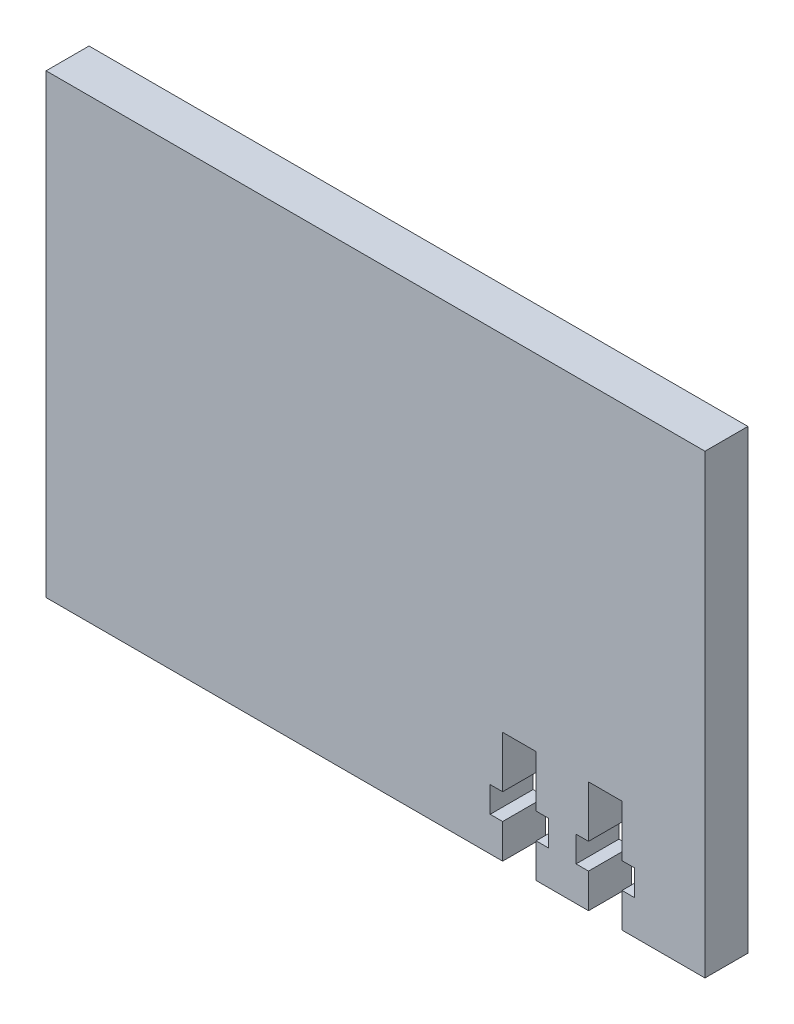
ISO-10303-21;
HEADER;
FILE_DESCRIPTION(('STEP AP214'),'2;1');
FILE_NAME('part.step','',(''),(''),'','','');
FILE_SCHEMA(('AUTOMOTIVE_DESIGN { 1 0 10303 214 1 1 1 1 }'));
ENDSEC;
DATA;
#1=APPLICATION_CONTEXT('core data for automotive mechanical design processes');
#2=APPLICATION_PROTOCOL_DEFINITION('international standard','automotive_design',2000,#1);
#3=PRODUCT_CONTEXT('',#1,'mechanical');
#4=PRODUCT('Part','Part','',(#3));
#5=PRODUCT_RELATED_PRODUCT_CATEGORY('part','',(#4));
#6=PRODUCT_DEFINITION_FORMATION('','',#4);
#7=PRODUCT_DEFINITION_CONTEXT('part definition',#1,'design');
#8=PRODUCT_DEFINITION('design','',#6,#7);
#9=PRODUCT_DEFINITION_SHAPE('','',#8);
#10=(LENGTH_UNIT() NAMED_UNIT(*) SI_UNIT(.MILLI.,.METRE.));
#11=(NAMED_UNIT(*) PLANE_ANGLE_UNIT() SI_UNIT($,.RADIAN.));
#12=(NAMED_UNIT(*) SI_UNIT($,.STERADIAN.) SOLID_ANGLE_UNIT());
#13=UNCERTAINTY_MEASURE_WITH_UNIT(LENGTH_MEASURE(1.E-05),#10,'distance_accuracy_value','');
#14=(GEOMETRIC_REPRESENTATION_CONTEXT(3) GLOBAL_UNCERTAINTY_ASSIGNED_CONTEXT((#13)) GLOBAL_UNIT_ASSIGNED_CONTEXT((#10,
#11,#12)) REPRESENTATION_CONTEXT('',''));
#15=CARTESIAN_POINT('',(0.,0.,0.));
#16=DIRECTION('',(0.,0.,1.));
#17=DIRECTION('',(1.,0.,0.));
#18=AXIS2_PLACEMENT_3D('',#15,#16,#17);
#19=CARTESIAN_POINT('',(-222.995661641974,-55.,-5.));
#20=DIRECTION('',(0.,1.,0.));
#21=DIRECTION('',(-1.,0.,0.));
#22=AXIS2_PLACEMENT_3D('',#19,#20,#21);
#23=PLANE('',#22);
#24=DIRECTION('',(-1.,0.,0.));
#25=VECTOR('',#24,1.);
#26=CARTESIAN_POINT('',(-222.995661641974,-55.,0.));
#27=LINE('',#26,#25);
#28=CARTESIAN_POINT('',(-146.2775,-55.,0.));
#29=VERTEX_POINT('',#28);
#30=CARTESIAN_POINT('',(-155.9375,-55.0000000000002,0.));
#31=VERTEX_POINT('',#30);
#32=EDGE_CURVE('E260',#29,#31,#27,.T.);
#33=ORIENTED_EDGE('',*,*,#32,.T.);
#34=DIRECTION('',(0.,0.,-1.));
#35=VECTOR('',#34,1.);
#36=CARTESIAN_POINT('',(-155.9375,-55.0000000000002,5.));
#37=LINE('',#36,#35);
#38=CARTESIAN_POINT('',(-155.9375,-55.0000000000002,-5.));
#39=VERTEX_POINT('',#38);
#40=EDGE_CURVE('E257',#31,#39,#37,.T.);
#41=ORIENTED_EDGE('',*,*,#40,.T.);
#42=DIRECTION('',(-1.,0.,0.));
#43=VECTOR('',#42,1.);
#44=CARTESIAN_POINT('',(-222.995661641974,-55.,-5.));
#45=LINE('',#44,#43);
#46=CARTESIAN_POINT('',(-146.2775,-55.,-5.));
#47=VERTEX_POINT('',#46);
#48=EDGE_CURVE('E242',#47,#39,#45,.T.);
#49=ORIENTED_EDGE('',*,*,#48,.F.);
#50=DIRECTION('',(0.,0.,1.));
#51=VECTOR('',#50,1.);
#52=CARTESIAN_POINT('',(-146.2775,-55.,-5.));
#53=LINE('',#52,#51);
#54=EDGE_CURVE('E272',#47,#29,#53,.T.);
#55=ORIENTED_EDGE('',*,*,#54,.T.);
#56=EDGE_LOOP('',(#33,#41,#49,#55));
#57=FACE_BOUND('',#56,.T.);
#58=ADVANCED_FACE('F33',(#57),#23,.F.);
#59=CARTESIAN_POINT('',(-159.8375,-55.0000000000002,-5.));
#60=VERTEX_POINT('',#59);
#61=CARTESIAN_POINT('',(-165.9375,-55.,-5.));
#62=VERTEX_POINT('',#61);
#63=EDGE_CURVE('E234',#60,#62,#45,.T.);
#64=ORIENTED_EDGE('',*,*,#63,.F.);
#65=DIRECTION('',(0.,0.,-1.));
#66=VECTOR('',#65,1.);
#67=CARTESIAN_POINT('',(-159.8375,-55.0000000000002,5.));
#68=LINE('',#67,#66);
#69=CARTESIAN_POINT('',(-159.8375,-55.0000000000002,0.));
#70=VERTEX_POINT('',#69);
#71=EDGE_CURVE('E216',#70,#60,#68,.T.);
#72=ORIENTED_EDGE('',*,*,#71,.F.);
#73=CARTESIAN_POINT('',(-165.9375,-55.,0.));
#74=VERTEX_POINT('',#73);
#75=EDGE_CURVE('E264',#70,#74,#27,.T.);
#76=ORIENTED_EDGE('',*,*,#75,.T.);
#77=DIRECTION('',(0.,0.,-1.));
#78=VECTOR('',#77,1.);
#79=CARTESIAN_POINT('',(-165.9375,-55.,5.));
#80=LINE('',#79,#78);
#81=EDGE_CURVE('E238',#74,#62,#80,.T.);
#82=ORIENTED_EDGE('',*,*,#81,.T.);
#83=EDGE_LOOP('',(#64,#72,#76,#82));
#84=FACE_BOUND('',#83,.T.);
#85=ADVANCED_FACE('F241',(#84),#23,.F.);
#86=CARTESIAN_POINT('',(-222.995661641974,-1.87999999999998,-5.));
#87=DIRECTION('',(0.,-1.,0.));
#88=DIRECTION('',(1.,0.,0.));
#89=AXIS2_PLACEMENT_3D('',#86,#87,#88);
#90=PLANE('',#89);
#91=DIRECTION('',(1.,0.,0.));
#92=VECTOR('',#91,1.);
#93=CARTESIAN_POINT('',(-222.995661641974,-1.87999999999998,0.));
#94=LINE('',#93,#92);
#95=CARTESIAN_POINT('',(-222.995661641974,-1.87999999999998,0.));
#96=VERTEX_POINT('',#95);
#97=CARTESIAN_POINT('',(-146.2775,-1.87999999999999,0.));
#98=VERTEX_POINT('',#97);
#99=EDGE_CURVE('E253',#96,#98,#94,.T.);
#100=ORIENTED_EDGE('',*,*,#99,.T.);
#101=DIRECTION('',(0.,0.,1.));
#102=VECTOR('',#101,1.);
#103=CARTESIAN_POINT('',(-146.2775,-1.87999999999999,-5.));
#104=LINE('',#103,#102);
#105=CARTESIAN_POINT('',(-146.2775,-1.87999999999999,-5.));
#106=VERTEX_POINT('',#105);
#107=EDGE_CURVE('E275',#106,#98,#104,.T.);
#108=ORIENTED_EDGE('',*,*,#107,.F.);
#109=DIRECTION('',(1.,0.,0.));
#110=VECTOR('',#109,1.);
#111=CARTESIAN_POINT('',(-222.995661641974,-1.87999999999998,-5.));
#112=LINE('',#111,#110);
#113=CARTESIAN_POINT('',(-222.995661641974,-1.87999999999998,-5.));
#114=VERTEX_POINT('',#113);
#115=EDGE_CURVE('E266',#114,#106,#112,.T.);
#116=ORIENTED_EDGE('',*,*,#115,.F.);
#117=DIRECTION('',(0.,0.,1.));
#118=VECTOR('',#117,1.);
#119=CARTESIAN_POINT('',(-222.995661641974,-1.87999999999998,-5.));
#120=LINE('',#119,#118);
#121=EDGE_CURVE('E252',#114,#96,#120,.T.);
#122=ORIENTED_EDGE('',*,*,#121,.T.);
#123=EDGE_LOOP('',(#100,#108,#116,#122));
#124=FACE_BOUND('',#123,.T.);
#125=ADVANCED_FACE('F35',(#124),#90,.F.);
#126=CARTESIAN_POINT('',(-146.2775,-1.87999999999999,-5.));
#127=DIRECTION('',(-1.,0.,0.));
#128=DIRECTION('',(0.,0.,1.));
#129=AXIS2_PLACEMENT_3D('',#126,#127,#128);
#130=PLANE('',#129);
#131=DIRECTION('',(0.,-1.,0.));
#132=VECTOR('',#131,1.);
#133=CARTESIAN_POINT('',(-146.2775,-1.87999999999999,0.));
#134=LINE('',#133,#132);
#135=EDGE_CURVE('E256',#98,#29,#134,.T.);
#136=ORIENTED_EDGE('',*,*,#135,.T.);
#137=ORIENTED_EDGE('',*,*,#54,.F.);
#138=DIRECTION('',(0.,-1.,0.));
#139=VECTOR('',#138,1.);
#140=CARTESIAN_POINT('',(-146.2775,-1.87999999999999,-5.));
#141=LINE('',#140,#139);
#142=EDGE_CURVE('E247',#106,#47,#141,.T.);
#143=ORIENTED_EDGE('',*,*,#142,.F.);
#144=ORIENTED_EDGE('',*,*,#107,.T.);
#145=EDGE_LOOP('',(#136,#137,#143,#144));
#146=FACE_BOUND('',#145,.T.);
#147=ADVANCED_FACE('F430',(#146),#130,.F.);
#148=CARTESIAN_POINT('',(-169.8375,-55.,-5.));
#149=VERTEX_POINT('',#148);
#150=CARTESIAN_POINT('',(-222.995661641974,-55.,-5.));
#151=VERTEX_POINT('',#150);
#152=EDGE_CURVE('E243',#149,#151,#45,.T.);
#153=ORIENTED_EDGE('',*,*,#152,.F.);
#154=DIRECTION('',(0.,0.,-1.));
#155=VECTOR('',#154,1.);
#156=CARTESIAN_POINT('',(-169.8375,-55.,5.));
#157=LINE('',#156,#155);
#158=CARTESIAN_POINT('',(-169.8375,-55.,0.));
#159=VERTEX_POINT('',#158);
#160=EDGE_CURVE('E403',#159,#149,#157,.T.);
#161=ORIENTED_EDGE('',*,*,#160,.F.);
#162=CARTESIAN_POINT('',(-222.995661641974,-55.,0.));
#163=VERTEX_POINT('',#162);
#164=EDGE_CURVE('E259',#159,#163,#27,.T.);
#165=ORIENTED_EDGE('',*,*,#164,.T.);
#166=DIRECTION('',(0.,0.,1.));
#167=VECTOR('',#166,1.);
#168=CARTESIAN_POINT('',(-222.995661641974,-55.,-5.));
#169=LINE('',#168,#167);
#170=EDGE_CURVE('E269',#151,#163,#169,.T.);
#171=ORIENTED_EDGE('',*,*,#170,.F.);
#172=EDGE_LOOP('',(#153,#161,#165,#171));
#173=FACE_BOUND('',#172,.T.);
#174=ADVANCED_FACE('F470',(#173),#23,.F.);
#175=CARTESIAN_POINT('',(-222.995661641974,-1.87999999999998,-5.));
#176=DIRECTION('',(1.,0.,0.));
#177=DIRECTION('',(0.,1.,0.));
#178=AXIS2_PLACEMENT_3D('',#175,#176,#177);
#179=PLANE('',#178);
#180=DIRECTION('',(0.,1.,0.));
#181=VECTOR('',#180,1.);
#182=CARTESIAN_POINT('',(-222.995661641974,-1.87999999999998,0.));
#183=LINE('',#182,#181);
#184=EDGE_CURVE('E263',#163,#96,#183,.T.);
#185=ORIENTED_EDGE('',*,*,#184,.T.);
#186=ORIENTED_EDGE('',*,*,#121,.F.);
#187=DIRECTION('',(0.,1.,0.));
#188=VECTOR('',#187,1.);
#189=CARTESIAN_POINT('',(-222.995661641974,-1.87999999999998,-5.));
#190=LINE('',#189,#188);
#191=EDGE_CURVE('E246',#151,#114,#190,.T.);
#192=ORIENTED_EDGE('',*,*,#191,.F.);
#193=ORIENTED_EDGE('',*,*,#170,.T.);
#194=EDGE_LOOP('',(#185,#186,#192,#193));
#195=FACE_BOUND('',#194,.T.);
#196=ADVANCED_FACE('F474',(#195),#179,.F.);
#197=CARTESIAN_POINT('',(0.,0.,-5.));
#198=DIRECTION('',(0.,0.,-1.));
#199=DIRECTION('',(-1.,0.,0.));
#200=AXIS2_PLACEMENT_3D('',#197,#198,#199);
#201=PLANE('',#200);
#202=DIRECTION('',(0.,-1.,0.));
#203=VECTOR('',#202,1.);
#204=CARTESIAN_POINT('',(-155.9375,-55.0000000000002,-5.));
#205=LINE('',#204,#203);
#206=CARTESIAN_POINT('',(-155.9375,-51.0000000000002,-5.));
#207=VERTEX_POINT('',#206);
#208=EDGE_CURVE('E227',#207,#39,#205,.T.);
#209=ORIENTED_EDGE('',*,*,#208,.F.);
#210=DIRECTION('',(-1.,0.,0.));
#211=VECTOR('',#210,1.);
#212=CARTESIAN_POINT('',(-155.9375,-51.0000000000002,-5.));
#213=LINE('',#212,#211);
#214=CARTESIAN_POINT('',(-154.487499999999,-51.0000000000002,-5.));
#215=VERTEX_POINT('',#214);
#216=EDGE_CURVE('E436',#215,#207,#213,.T.);
#217=ORIENTED_EDGE('',*,*,#216,.F.);
#218=DIRECTION('',(0.,-1.,0.));
#219=VECTOR('',#218,1.);
#220=CARTESIAN_POINT('',(-154.487499999999,-48.0000000000002,-5.));
#221=LINE('',#220,#219);
#222=CARTESIAN_POINT('',(-154.487499999999,-48.0000000000002,-5.));
#223=VERTEX_POINT('',#222);
#224=EDGE_CURVE('E351',#223,#215,#221,.T.);
#225=ORIENTED_EDGE('',*,*,#224,.F.);
#226=DIRECTION('',(1.,0.,0.));
#227=VECTOR('',#226,1.);
#228=CARTESIAN_POINT('',(-155.9375,-48.0000000000002,-5.));
#229=LINE('',#228,#227);
#230=CARTESIAN_POINT('',(-155.9375,-48.0000000000002,-5.));
#231=VERTEX_POINT('',#230);
#232=EDGE_CURVE('E439',#231,#223,#229,.T.);
#233=ORIENTED_EDGE('',*,*,#232,.F.);
#234=DIRECTION('',(0.,-1.,0.));
#235=VECTOR('',#234,1.);
#236=CARTESIAN_POINT('',(-155.9375,-48.0000000000002,-5.));
#237=LINE('',#236,#235);
#238=CARTESIAN_POINT('',(-155.9375,-42.,-5.));
#239=VERTEX_POINT('',#238);
#240=EDGE_CURVE('E442',#239,#231,#237,.T.);
#241=ORIENTED_EDGE('',*,*,#240,.F.);
#242=DIRECTION('',(1.,0.,0.));
#243=VECTOR('',#242,1.);
#244=CARTESIAN_POINT('',(-155.9375,-42.,-5.));
#245=LINE('',#244,#243);
#246=CARTESIAN_POINT('',(-159.8375,-42.,-5.));
#247=VERTEX_POINT('',#246);
#248=EDGE_CURVE('E445',#247,#239,#245,.T.);
#249=ORIENTED_EDGE('',*,*,#248,.F.);
#250=DIRECTION('',(0.,1.,0.));
#251=VECTOR('',#250,1.);
#252=CARTESIAN_POINT('',(-159.8375,-48.0000000000002,-5.));
#253=LINE('',#252,#251);
#254=CARTESIAN_POINT('',(-159.8375,-48.0000000000002,-5.));
#255=VERTEX_POINT('',#254);
#256=EDGE_CURVE('E448',#255,#247,#253,.T.);
#257=ORIENTED_EDGE('',*,*,#256,.F.);
#258=DIRECTION('',(1.,0.,0.));
#259=VECTOR('',#258,1.);
#260=CARTESIAN_POINT('',(-159.8375,-48.0000000000002,-5.));
#261=LINE('',#260,#259);
#262=CARTESIAN_POINT('',(-161.287500000001,-48.0000000000002,-5.));
#263=VERTEX_POINT('',#262);
#264=EDGE_CURVE('E451',#263,#255,#261,.T.);
#265=ORIENTED_EDGE('',*,*,#264,.F.);
#266=DIRECTION('',(0.,1.,0.));
#267=VECTOR('',#266,1.);
#268=CARTESIAN_POINT('',(-161.287500000001,-48.0000000000002,-5.));
#269=LINE('',#268,#267);
#270=CARTESIAN_POINT('',(-161.287500000001,-51.0000000000002,-5.));
#271=VERTEX_POINT('',#270);
#272=EDGE_CURVE('E454',#271,#263,#269,.T.);
#273=ORIENTED_EDGE('',*,*,#272,.F.);
#274=DIRECTION('',(-1.,0.,0.));
#275=VECTOR('',#274,1.);
#276=CARTESIAN_POINT('',(-159.8375,-51.0000000000002,-5.));
#277=LINE('',#276,#275);
#278=CARTESIAN_POINT('',(-159.8375,-51.0000000000002,-5.));
#279=VERTEX_POINT('',#278);
#280=EDGE_CURVE('E237',#279,#271,#277,.T.);
#281=ORIENTED_EDGE('',*,*,#280,.F.);
#282=DIRECTION('',(0.,1.,0.));
#283=VECTOR('',#282,1.);
#284=CARTESIAN_POINT('',(-159.8375,-55.0000000000002,-5.));
#285=LINE('',#284,#283);
#286=EDGE_CURVE('E219',#60,#279,#285,.T.);
#287=ORIENTED_EDGE('',*,*,#286,.F.);
#288=ORIENTED_EDGE('',*,*,#63,.T.);
#289=DIRECTION('',(0.,-1.,0.));
#290=VECTOR('',#289,1.);
#291=CARTESIAN_POINT('',(-165.9375,-55.,-5.));
#292=LINE('',#291,#290);
#293=CARTESIAN_POINT('',(-165.9375,-51.,-5.));
#294=VERTEX_POINT('',#293);
#295=EDGE_CURVE('E401',#294,#62,#292,.T.);
#296=ORIENTED_EDGE('',*,*,#295,.F.);
#297=DIRECTION('',(-1.,0.,0.));
#298=VECTOR('',#297,1.);
#299=CARTESIAN_POINT('',(-165.9375,-51.,-5.));
#300=LINE('',#299,#298);
#301=CARTESIAN_POINT('',(-164.4875,-51.,-5.));
#302=VERTEX_POINT('',#301);
#303=EDGE_CURVE('E398',#302,#294,#300,.T.);
#304=ORIENTED_EDGE('',*,*,#303,.F.);
#305=DIRECTION('',(0.,-1.,0.));
#306=VECTOR('',#305,1.);
#307=CARTESIAN_POINT('',(-164.4875,-48.,-5.));
#308=LINE('',#307,#306);
#309=CARTESIAN_POINT('',(-164.4875,-48.,-5.));
#310=VERTEX_POINT('',#309);
#311=EDGE_CURVE('E395',#310,#302,#308,.T.);
#312=ORIENTED_EDGE('',*,*,#311,.F.);
#313=DIRECTION('',(1.,0.,0.));
#314=VECTOR('',#313,1.);
#315=CARTESIAN_POINT('',(-165.9375,-48.,-5.));
#316=LINE('',#315,#314);
#317=CARTESIAN_POINT('',(-165.9375,-48.,-5.));
#318=VERTEX_POINT('',#317);
#319=EDGE_CURVE('E392',#318,#310,#316,.T.);
#320=ORIENTED_EDGE('',*,*,#319,.F.);
#321=DIRECTION('',(0.,-1.,0.));
#322=VECTOR('',#321,1.);
#323=CARTESIAN_POINT('',(-165.9375,-48.,-5.));
#324=LINE('',#323,#322);
#325=CARTESIAN_POINT('',(-165.9375,-42.,-5.));
#326=VERTEX_POINT('',#325);
#327=EDGE_CURVE('E389',#326,#318,#324,.T.);
#328=ORIENTED_EDGE('',*,*,#327,.F.);
#329=DIRECTION('',(1.,0.,0.));
#330=VECTOR('',#329,1.);
#331=CARTESIAN_POINT('',(-165.9375,-42.,-5.));
#332=LINE('',#331,#330);
#333=CARTESIAN_POINT('',(-169.8375,-42.,-5.));
#334=VERTEX_POINT('',#333);
#335=EDGE_CURVE('E386',#334,#326,#332,.T.);
#336=ORIENTED_EDGE('',*,*,#335,.F.);
#337=DIRECTION('',(0.,1.,0.));
#338=VECTOR('',#337,1.);
#339=CARTESIAN_POINT('',(-169.8375,-48.,-5.));
#340=LINE('',#339,#338);
#341=CARTESIAN_POINT('',(-169.8375,-48.,-5.));
#342=VERTEX_POINT('',#341);
#343=EDGE_CURVE('E383',#342,#334,#340,.T.);
#344=ORIENTED_EDGE('',*,*,#343,.F.);
#345=DIRECTION('',(1.,0.,0.));
#346=VECTOR('',#345,1.);
#347=CARTESIAN_POINT('',(-169.8375,-48.,-5.));
#348=LINE('',#347,#346);
#349=CARTESIAN_POINT('',(-171.2875,-48.,-5.));
#350=VERTEX_POINT('',#349);
#351=EDGE_CURVE('E380',#350,#342,#348,.T.);
#352=ORIENTED_EDGE('',*,*,#351,.F.);
#353=DIRECTION('',(0.,1.,0.));
#354=VECTOR('',#353,1.);
#355=CARTESIAN_POINT('',(-171.2875,-48.,-5.));
#356=LINE('',#355,#354);
#357=CARTESIAN_POINT('',(-171.2875,-51.,-5.));
#358=VERTEX_POINT('',#357);
#359=EDGE_CURVE('E377',#358,#350,#356,.T.);
#360=ORIENTED_EDGE('',*,*,#359,.F.);
#361=DIRECTION('',(-1.,0.,0.));
#362=VECTOR('',#361,1.);
#363=CARTESIAN_POINT('',(-169.8375,-51.,-5.));
#364=LINE('',#363,#362);
#365=CARTESIAN_POINT('',(-169.8375,-51.,-5.));
#366=VERTEX_POINT('',#365);
#367=EDGE_CURVE('E374',#366,#358,#364,.T.);
#368=ORIENTED_EDGE('',*,*,#367,.F.);
#369=DIRECTION('',(0.,1.,0.));
#370=VECTOR('',#369,1.);
#371=CARTESIAN_POINT('',(-169.8375,-55.,-5.));
#372=LINE('',#371,#370);
#373=EDGE_CURVE('E372',#149,#366,#372,.T.);
#374=ORIENTED_EDGE('',*,*,#373,.F.);
#375=ORIENTED_EDGE('',*,*,#152,.T.);
#376=ORIENTED_EDGE('',*,*,#191,.T.);
#377=ORIENTED_EDGE('',*,*,#115,.T.);
#378=ORIENTED_EDGE('',*,*,#142,.T.);
#379=ORIENTED_EDGE('',*,*,#48,.T.);
#380=EDGE_LOOP('',(#209,#217,#225,#233,#241,#249,#257,#265,#273,#281,#287,#288,#296,#304,#312,
#320,#328,#336,#344,#352,#360,#368,#374,#375,#376,#377,#378,#379));
#381=FACE_BOUND('',#380,.T.);
#382=ADVANCED_FACE('F232',(#381),#201,.T.);
#383=CARTESIAN_POINT('',(0.,0.,0.));
#384=DIRECTION('',(0.,0.,-1.));
#385=DIRECTION('',(-1.,0.,0.));
#386=AXIS2_PLACEMENT_3D('',#383,#384,#385);
#387=PLANE('',#386);
#388=DIRECTION('',(-1.,0.,0.));
#389=VECTOR('',#388,1.);
#390=CARTESIAN_POINT('',(0.,-51.0000000000002,0.));
#391=LINE('',#390,#389);
#392=CARTESIAN_POINT('',(-154.487499999999,-51.0000000000002,0.));
#393=VERTEX_POINT('',#392);
#394=CARTESIAN_POINT('',(-155.9375,-51.0000000000002,0.));
#395=VERTEX_POINT('',#394);
#396=EDGE_CURVE('E41',#393,#395,#391,.T.);
#397=ORIENTED_EDGE('',*,*,#396,.T.);
#398=DIRECTION('',(0.,-1.,0.));
#399=VECTOR('',#398,1.);
#400=CARTESIAN_POINT('',(-155.9375,0.,0.));
#401=LINE('',#400,#399);
#402=EDGE_CURVE('E11',#395,#31,#401,.T.);
#403=ORIENTED_EDGE('',*,*,#402,.T.);
#404=ORIENTED_EDGE('',*,*,#32,.F.);
#405=ORIENTED_EDGE('',*,*,#135,.F.);
#406=ORIENTED_EDGE('',*,*,#99,.F.);
#407=ORIENTED_EDGE('',*,*,#184,.F.);
#408=ORIENTED_EDGE('',*,*,#164,.F.);
#409=DIRECTION('',(0.,1.,0.));
#410=VECTOR('',#409,1.);
#411=CARTESIAN_POINT('',(-169.8375,1.17848439340484E-12,0.));
#412=LINE('',#411,#410);
#413=CARTESIAN_POINT('',(-169.8375,-51.,0.));
#414=VERTEX_POINT('',#413);
#415=EDGE_CURVE('E278',#159,#414,#412,.T.);
#416=ORIENTED_EDGE('',*,*,#415,.T.);
#417=DIRECTION('',(-1.,0.,0.));
#418=VECTOR('',#417,1.);
#419=CARTESIAN_POINT('',(-2.44057647654671E-13,-51.0000000000008,0.));
#420=LINE('',#419,#418);
#421=CARTESIAN_POINT('',(-171.2875,-51.,0.));
#422=VERTEX_POINT('',#421);
#423=EDGE_CURVE('E281',#414,#422,#420,.T.);
#424=ORIENTED_EDGE('',*,*,#423,.T.);
#425=DIRECTION('',(0.,1.,0.));
#426=VECTOR('',#425,1.);
#427=CARTESIAN_POINT('',(-171.2875,0.,0.));
#428=LINE('',#427,#426);
#429=CARTESIAN_POINT('',(-171.2875,-48.,0.));
#430=VERTEX_POINT('',#429);
#431=EDGE_CURVE('E284',#422,#430,#428,.T.);
#432=ORIENTED_EDGE('',*,*,#431,.T.);
#433=DIRECTION('',(1.,0.,0.));
#434=VECTOR('',#433,1.);
#435=CARTESIAN_POINT('',(-2.2970131543969E-13,-48.0000000000008,0.));
#436=LINE('',#435,#434);
#437=CARTESIAN_POINT('',(-169.8375,-48.,0.));
#438=VERTEX_POINT('',#437);
#439=EDGE_CURVE('E287',#430,#438,#436,.T.);
#440=ORIENTED_EDGE('',*,*,#439,.T.);
#441=DIRECTION('',(0.,1.,0.));
#442=VECTOR('',#441,1.);
#443=CARTESIAN_POINT('',(-169.8375,-7.85656262269896E-13,0.));
#444=LINE('',#443,#442);
#445=CARTESIAN_POINT('',(-169.8375,-42.,0.));
#446=VERTEX_POINT('',#445);
#447=EDGE_CURVE('E290',#438,#446,#444,.T.);
#448=ORIENTED_EDGE('',*,*,#447,.T.);
#449=DIRECTION('',(1.,0.,0.));
#450=VECTOR('',#449,1.);
#451=CARTESIAN_POINT('',(0.,-42.,0.));
#452=LINE('',#451,#450);
#453=CARTESIAN_POINT('',(-165.9375,-42.,0.));
#454=VERTEX_POINT('',#453);
#455=EDGE_CURVE('E293',#446,#454,#452,.T.);
#456=ORIENTED_EDGE('',*,*,#455,.T.);
#457=DIRECTION('',(0.,-1.,0.));
#458=VECTOR('',#457,1.);
#459=CARTESIAN_POINT('',(-165.9375,7.67615138119735E-13,0.));
#460=LINE('',#459,#458);
#461=CARTESIAN_POINT('',(-165.9375,-48.,0.));
#462=VERTEX_POINT('',#461);
#463=EDGE_CURVE('E296',#454,#462,#460,.T.);
#464=ORIENTED_EDGE('',*,*,#463,.T.);
#465=DIRECTION('',(1.,0.,0.));
#466=VECTOR('',#465,1.);
#467=CARTESIAN_POINT('',(2.29701315439683E-13,-47.9999999999992,0.));
#468=LINE('',#467,#466);
#469=CARTESIAN_POINT('',(-164.4875,-48.,0.));
#470=VERTEX_POINT('',#469);
#471=EDGE_CURVE('E299',#462,#470,#468,.T.);
#472=ORIENTED_EDGE('',*,*,#471,.T.);
#473=DIRECTION('',(0.,-1.,0.));
#474=VECTOR('',#473,1.);
#475=CARTESIAN_POINT('',(-164.4875,0.,0.));
#476=LINE('',#475,#474);
#477=CARTESIAN_POINT('',(-164.4875,-51.,0.));
#478=VERTEX_POINT('',#477);
#479=EDGE_CURVE('E302',#470,#478,#476,.T.);
#480=ORIENTED_EDGE('',*,*,#479,.T.);
#481=DIRECTION('',(-1.,0.,0.));
#482=VECTOR('',#481,1.);
#483=CARTESIAN_POINT('',(2.44057647654663E-13,-50.9999999999992,0.));
#484=LINE('',#483,#482);
#485=CARTESIAN_POINT('',(-165.9375,-51.,0.));
#486=VERTEX_POINT('',#485);
#487=EDGE_CURVE('E305',#478,#486,#484,.T.);
#488=ORIENTED_EDGE('',*,*,#487,.T.);
#489=DIRECTION('',(0.,-1.,0.));
#490=VECTOR('',#489,1.);
#491=CARTESIAN_POINT('',(-165.9375,0.,0.));
#492=LINE('',#491,#490);
#493=EDGE_CURVE('E308',#486,#74,#492,.T.);
#494=ORIENTED_EDGE('',*,*,#493,.T.);
#495=ORIENTED_EDGE('',*,*,#75,.F.);
#496=DIRECTION('',(0.,1.,0.));
#497=VECTOR('',#496,1.);
#498=CARTESIAN_POINT('',(-159.8375,-1.10909545436577E-12,0.));
#499=LINE('',#498,#497);
#500=CARTESIAN_POINT('',(-159.8375,-51.0000000000002,0.));
#501=VERTEX_POINT('',#500);
#502=EDGE_CURVE('E222',#70,#501,#499,.T.);
#503=ORIENTED_EDGE('',*,*,#502,.T.);
#504=DIRECTION('',(-1.,0.,0.));
#505=VECTOR('',#504,1.);
#506=CARTESIAN_POINT('',(0.,-51.0000000000002,0.));
#507=LINE('',#506,#505);
#508=CARTESIAN_POINT('',(-161.287500000001,-51.0000000000002,0.));
#509=VERTEX_POINT('',#508);
#510=EDGE_CURVE('E312',#501,#509,#507,.T.);
#511=ORIENTED_EDGE('',*,*,#510,.T.);
#512=DIRECTION('',(0.,1.,0.));
#513=VECTOR('',#512,1.);
#514=CARTESIAN_POINT('',(-161.287500000001,0.,0.));
#515=LINE('',#514,#513);
#516=CARTESIAN_POINT('',(-161.287500000001,-48.0000000000002,0.));
#517=VERTEX_POINT('',#516);
#518=EDGE_CURVE('E315',#509,#517,#515,.T.);
#519=ORIENTED_EDGE('',*,*,#518,.T.);
#520=DIRECTION('',(1.,0.,0.));
#521=VECTOR('',#520,1.);
#522=CARTESIAN_POINT('',(0.,-48.0000000000002,0.));
#523=LINE('',#522,#521);
#524=CARTESIAN_POINT('',(-159.8375,-48.0000000000002,0.));
#525=VERTEX_POINT('',#524);
#526=EDGE_CURVE('E318',#517,#525,#523,.T.);
#527=ORIENTED_EDGE('',*,*,#526,.T.);
#528=DIRECTION('',(0.,1.,0.));
#529=VECTOR('',#528,1.);
#530=CARTESIAN_POINT('',(-159.8375,0.,0.));
#531=LINE('',#530,#529);
#532=CARTESIAN_POINT('',(-159.8375,-42.,0.));
#533=VERTEX_POINT('',#532);
#534=EDGE_CURVE('E321',#525,#533,#531,.T.);
#535=ORIENTED_EDGE('',*,*,#534,.T.);
#536=DIRECTION('',(1.,0.,0.));
#537=VECTOR('',#536,1.);
#538=CARTESIAN_POINT('',(0.,-42.,0.));
#539=LINE('',#538,#537);
#540=CARTESIAN_POINT('',(-155.9375,-42.,0.));
#541=VERTEX_POINT('',#540);
#542=EDGE_CURVE('E324',#533,#541,#539,.T.);
#543=ORIENTED_EDGE('',*,*,#542,.T.);
#544=DIRECTION('',(0.,-1.,0.));
#545=VECTOR('',#544,1.);
#546=CARTESIAN_POINT('',(-155.9375,0.,0.));
#547=LINE('',#546,#545);
#548=CARTESIAN_POINT('',(-155.9375,-48.0000000000002,0.));
#549=VERTEX_POINT('',#548);
#550=EDGE_CURVE('E327',#541,#549,#547,.T.);
#551=ORIENTED_EDGE('',*,*,#550,.T.);
#552=DIRECTION('',(1.,0.,0.));
#553=VECTOR('',#552,1.);
#554=CARTESIAN_POINT('',(0.,-48.0000000000002,0.));
#555=LINE('',#554,#553);
#556=CARTESIAN_POINT('',(-154.487499999999,-48.0000000000002,0.));
#557=VERTEX_POINT('',#556);
#558=EDGE_CURVE('E330',#549,#557,#555,.T.);
#559=ORIENTED_EDGE('',*,*,#558,.T.);
#560=DIRECTION('',(0.,-1.,0.));
#561=VECTOR('',#560,1.);
#562=CARTESIAN_POINT('',(-154.487499999999,0.,0.));
#563=LINE('',#562,#561);
#564=EDGE_CURVE('E333',#557,#393,#563,.T.);
#565=ORIENTED_EDGE('',*,*,#564,.T.);
#566=EDGE_LOOP('',(#397,#403,#404,#405,#406,#407,#408,#416,#424,#432,#440,#448,#456,#464,#472,
#480,#488,#494,#495,#503,#511,#519,#527,#535,#543,#551,#559,#565));
#567=FACE_BOUND('',#566,.T.);
#568=ADVANCED_FACE('F337',(#567),#387,.F.);
#569=CARTESIAN_POINT('',(-165.9375,-55.,5.));
#570=DIRECTION('',(1.,0.,0.));
#571=DIRECTION('',(0.,0.,-1.));
#572=AXIS2_PLACEMENT_3D('',#569,#570,#571);
#573=PLANE('',#572);
#574=DIRECTION('',(0.,0.,-1.));
#575=VECTOR('',#574,1.);
#576=CARTESIAN_POINT('',(-165.9375,-51.,5.));
#577=LINE('',#576,#575);
#578=EDGE_CURVE('E405',#486,#294,#577,.T.);
#579=ORIENTED_EDGE('',*,*,#578,.T.);
#580=ORIENTED_EDGE('',*,*,#295,.T.);
#581=ORIENTED_EDGE('',*,*,#81,.F.);
#582=ORIENTED_EDGE('',*,*,#493,.F.);
#583=EDGE_LOOP('',(#579,#580,#581,#582));
#584=FACE_BOUND('',#583,.T.);
#585=ADVANCED_FACE('F498',(#584),#573,.F.);
#586=CARTESIAN_POINT('',(-165.9375,-51.,5.));
#587=DIRECTION('',(0.,-1.,0.));
#588=DIRECTION('',(1.,0.,0.));
#589=AXIS2_PLACEMENT_3D('',#586,#587,#588);
#590=PLANE('',#589);
#591=DIRECTION('',(0.,0.,-1.));
#592=VECTOR('',#591,1.);
#593=CARTESIAN_POINT('',(-164.4875,-51.,5.));
#594=LINE('',#593,#592);
#595=EDGE_CURVE('E407',#478,#302,#594,.T.);
#596=ORIENTED_EDGE('',*,*,#595,.T.);
#597=ORIENTED_EDGE('',*,*,#303,.T.);
#598=ORIENTED_EDGE('',*,*,#578,.F.);
#599=ORIENTED_EDGE('',*,*,#487,.F.);
#600=EDGE_LOOP('',(#596,#597,#598,#599));
#601=FACE_BOUND('',#600,.T.);
#602=ADVANCED_FACE('F535',(#601),#590,.F.);
#603=CARTESIAN_POINT('',(-164.4875,-48.,5.));
#604=DIRECTION('',(1.,0.,0.));
#605=DIRECTION('',(0.,0.,-1.));
#606=AXIS2_PLACEMENT_3D('',#603,#604,#605);
#607=PLANE('',#606);
#608=DIRECTION('',(0.,0.,-1.));
#609=VECTOR('',#608,1.);
#610=CARTESIAN_POINT('',(-164.4875,-48.,5.));
#611=LINE('',#610,#609);
#612=EDGE_CURVE('E409',#470,#310,#611,.T.);
#613=ORIENTED_EDGE('',*,*,#612,.T.);
#614=ORIENTED_EDGE('',*,*,#311,.T.);
#615=ORIENTED_EDGE('',*,*,#595,.F.);
#616=ORIENTED_EDGE('',*,*,#479,.F.);
#617=EDGE_LOOP('',(#613,#614,#615,#616));
#618=FACE_BOUND('',#617,.T.);
#619=ADVANCED_FACE('F531',(#618),#607,.F.);
#620=CARTESIAN_POINT('',(-165.9375,-48.,5.));
#621=DIRECTION('',(0.,1.,0.));
#622=DIRECTION('',(-1.,0.,0.));
#623=AXIS2_PLACEMENT_3D('',#620,#621,#622);
#624=PLANE('',#623);
#625=DIRECTION('',(0.,0.,-1.));
#626=VECTOR('',#625,1.);
#627=CARTESIAN_POINT('',(-165.9375,-48.,5.));
#628=LINE('',#627,#626);
#629=EDGE_CURVE('E411',#462,#318,#628,.T.);
#630=ORIENTED_EDGE('',*,*,#629,.T.);
#631=ORIENTED_EDGE('',*,*,#319,.T.);
#632=ORIENTED_EDGE('',*,*,#612,.F.);
#633=ORIENTED_EDGE('',*,*,#471,.F.);
#634=EDGE_LOOP('',(#630,#631,#632,#633));
#635=FACE_BOUND('',#634,.T.);
#636=ADVANCED_FACE('F527',(#635),#624,.F.);
#637=CARTESIAN_POINT('',(-165.9375,-48.,5.));
#638=DIRECTION('',(1.,0.,0.));
#639=DIRECTION('',(0.,1.,0.));
#640=AXIS2_PLACEMENT_3D('',#637,#638,#639);
#641=PLANE('',#640);
#642=DIRECTION('',(0.,0.,-1.));
#643=VECTOR('',#642,1.);
#644=CARTESIAN_POINT('',(-165.9375,-42.,5.));
#645=LINE('',#644,#643);
#646=EDGE_CURVE('E413',#454,#326,#645,.T.);
#647=ORIENTED_EDGE('',*,*,#646,.T.);
#648=ORIENTED_EDGE('',*,*,#327,.T.);
#649=ORIENTED_EDGE('',*,*,#629,.F.);
#650=ORIENTED_EDGE('',*,*,#463,.F.);
#651=EDGE_LOOP('',(#647,#648,#649,#650));
#652=FACE_BOUND('',#651,.T.);
#653=ADVANCED_FACE('F523',(#652),#641,.F.);
#654=CARTESIAN_POINT('',(-165.9375,-42.,5.));
#655=DIRECTION('',(0.,1.,0.));
#656=DIRECTION('',(0.,0.,1.));
#657=AXIS2_PLACEMENT_3D('',#654,#655,#656);
#658=PLANE('',#657);
#659=DIRECTION('',(0.,0.,-1.));
#660=VECTOR('',#659,1.);
#661=CARTESIAN_POINT('',(-169.8375,-42.,5.));
#662=LINE('',#661,#660);
#663=EDGE_CURVE('E415',#446,#334,#662,.T.);
#664=ORIENTED_EDGE('',*,*,#663,.T.);
#665=ORIENTED_EDGE('',*,*,#335,.T.);
#666=ORIENTED_EDGE('',*,*,#646,.F.);
#667=ORIENTED_EDGE('',*,*,#455,.F.);
#668=EDGE_LOOP('',(#664,#665,#666,#667));
#669=FACE_BOUND('',#668,.T.);
#670=ADVANCED_FACE('F519',(#669),#658,.F.);
#671=CARTESIAN_POINT('',(-169.8375,-48.,5.));
#672=DIRECTION('',(-1.,0.,0.));
#673=DIRECTION('',(0.,-1.,0.));
#674=AXIS2_PLACEMENT_3D('',#671,#672,#673);
#675=PLANE('',#674);
#676=DIRECTION('',(0.,0.,-1.));
#677=VECTOR('',#676,1.);
#678=CARTESIAN_POINT('',(-169.8375,-48.,5.));
#679=LINE('',#678,#677);
#680=EDGE_CURVE('E417',#438,#342,#679,.T.);
#681=ORIENTED_EDGE('',*,*,#680,.T.);
#682=ORIENTED_EDGE('',*,*,#343,.T.);
#683=ORIENTED_EDGE('',*,*,#663,.F.);
#684=ORIENTED_EDGE('',*,*,#447,.F.);
#685=EDGE_LOOP('',(#681,#682,#683,#684));
#686=FACE_BOUND('',#685,.T.);
#687=ADVANCED_FACE('F515',(#686),#675,.F.);
#688=CARTESIAN_POINT('',(-169.8375,-48.,5.));
#689=DIRECTION('',(0.,1.,0.));
#690=DIRECTION('',(-1.,0.,0.));
#691=AXIS2_PLACEMENT_3D('',#688,#689,#690);
#692=PLANE('',#691);
#693=DIRECTION('',(0.,0.,-1.));
#694=VECTOR('',#693,1.);
#695=CARTESIAN_POINT('',(-171.2875,-48.,5.));
#696=LINE('',#695,#694);
#697=EDGE_CURVE('E419',#430,#350,#696,.T.);
#698=ORIENTED_EDGE('',*,*,#697,.T.);
#699=ORIENTED_EDGE('',*,*,#351,.T.);
#700=ORIENTED_EDGE('',*,*,#680,.F.);
#701=ORIENTED_EDGE('',*,*,#439,.F.);
#702=EDGE_LOOP('',(#698,#699,#700,#701));
#703=FACE_BOUND('',#702,.T.);
#704=ADVANCED_FACE('F511',(#703),#692,.F.);
#705=CARTESIAN_POINT('',(-171.2875,-48.,5.));
#706=DIRECTION('',(-1.,0.,0.));
#707=DIRECTION('',(0.,0.,1.));
#708=AXIS2_PLACEMENT_3D('',#705,#706,#707);
#709=PLANE('',#708);
#710=DIRECTION('',(0.,0.,-1.));
#711=VECTOR('',#710,1.);
#712=CARTESIAN_POINT('',(-171.2875,-51.,5.));
#713=LINE('',#712,#711);
#714=EDGE_CURVE('E421',#422,#358,#713,.T.);
#715=ORIENTED_EDGE('',*,*,#714,.T.);
#716=ORIENTED_EDGE('',*,*,#359,.T.);
#717=ORIENTED_EDGE('',*,*,#697,.F.);
#718=ORIENTED_EDGE('',*,*,#431,.F.);
#719=EDGE_LOOP('',(#715,#716,#717,#718));
#720=FACE_BOUND('',#719,.T.);
#721=ADVANCED_FACE('F507',(#720),#709,.F.);
#722=CARTESIAN_POINT('',(-169.8375,-51.,5.));
#723=DIRECTION('',(0.,-1.,0.));
#724=DIRECTION('',(1.,0.,0.));
#725=AXIS2_PLACEMENT_3D('',#722,#723,#724);
#726=PLANE('',#725);
#727=DIRECTION('',(0.,0.,-1.));
#728=VECTOR('',#727,1.);
#729=CARTESIAN_POINT('',(-169.8375,-51.,5.));
#730=LINE('',#729,#728);
#731=EDGE_CURVE('E56',#414,#366,#730,.T.);
#732=ORIENTED_EDGE('',*,*,#731,.T.);
#733=ORIENTED_EDGE('',*,*,#367,.T.);
#734=ORIENTED_EDGE('',*,*,#714,.F.);
#735=ORIENTED_EDGE('',*,*,#423,.F.);
#736=EDGE_LOOP('',(#732,#733,#734,#735));
#737=FACE_BOUND('',#736,.T.);
#738=ADVANCED_FACE('F504',(#737),#726,.F.);
#739=CARTESIAN_POINT('',(-169.8375,-55.,5.));
#740=DIRECTION('',(-1.,0.,0.));
#741=DIRECTION('',(0.,-1.,0.));
#742=AXIS2_PLACEMENT_3D('',#739,#740,#741);
#743=PLANE('',#742);
#744=ORIENTED_EDGE('',*,*,#160,.T.);
#745=ORIENTED_EDGE('',*,*,#373,.T.);
#746=ORIENTED_EDGE('',*,*,#731,.F.);
#747=ORIENTED_EDGE('',*,*,#415,.F.);
#748=EDGE_LOOP('',(#744,#745,#746,#747));
#749=FACE_BOUND('',#748,.T.);
#750=ADVANCED_FACE('F500',(#749),#743,.F.);
#751=CARTESIAN_POINT('',(-155.9375,-55.0000000000002,5.));
#752=DIRECTION('',(1.,0.,0.));
#753=DIRECTION('',(0.,0.,-1.));
#754=AXIS2_PLACEMENT_3D('',#751,#752,#753);
#755=PLANE('',#754);
#756=DIRECTION('',(0.,0.,-1.));
#757=VECTOR('',#756,1.);
#758=CARTESIAN_POINT('',(-155.9375,-51.0000000000002,5.));
#759=LINE('',#758,#757);
#760=EDGE_CURVE('E346',#395,#207,#759,.T.);
#761=ORIENTED_EDGE('',*,*,#760,.T.);
#762=ORIENTED_EDGE('',*,*,#208,.T.);
#763=ORIENTED_EDGE('',*,*,#40,.F.);
#764=ORIENTED_EDGE('',*,*,#402,.F.);
#765=EDGE_LOOP('',(#761,#762,#763,#764));
#766=FACE_BOUND('',#765,.T.);
#767=ADVANCED_FACE('F503',(#766),#755,.F.);
#768=CARTESIAN_POINT('',(-155.9375,-51.0000000000002,5.));
#769=DIRECTION('',(0.,-1.,0.));
#770=DIRECTION('',(0.,0.,-1.));
#771=AXIS2_PLACEMENT_3D('',#768,#769,#770);
#772=PLANE('',#771);
#773=DIRECTION('',(0.,0.,-1.));
#774=VECTOR('',#773,1.);
#775=CARTESIAN_POINT('',(-154.487499999999,-51.0000000000002,5.));
#776=LINE('',#775,#774);
#777=EDGE_CURVE('E344',#393,#215,#776,.T.);
#778=ORIENTED_EDGE('',*,*,#777,.T.);
#779=ORIENTED_EDGE('',*,*,#216,.T.);
#780=ORIENTED_EDGE('',*,*,#760,.F.);
#781=ORIENTED_EDGE('',*,*,#396,.F.);
#782=EDGE_LOOP('',(#778,#779,#780,#781));
#783=FACE_BOUND('',#782,.T.);
#784=ADVANCED_FACE('F342',(#783),#772,.F.);
#785=CARTESIAN_POINT('',(-154.487499999999,-48.0000000000002,5.));
#786=DIRECTION('',(1.,0.,0.));
#787=DIRECTION('',(0.,0.,-1.));
#788=AXIS2_PLACEMENT_3D('',#785,#786,#787);
#789=PLANE('',#788);
#790=DIRECTION('',(0.,0.,-1.));
#791=VECTOR('',#790,1.);
#792=CARTESIAN_POINT('',(-154.487499999999,-48.0000000000002,5.));
#793=LINE('',#792,#791);
#794=EDGE_CURVE('E353',#557,#223,#793,.T.);
#795=ORIENTED_EDGE('',*,*,#794,.T.);
#796=ORIENTED_EDGE('',*,*,#224,.T.);
#797=ORIENTED_EDGE('',*,*,#777,.F.);
#798=ORIENTED_EDGE('',*,*,#564,.F.);
#799=EDGE_LOOP('',(#795,#796,#797,#798));
#800=FACE_BOUND('',#799,.T.);
#801=ADVANCED_FACE('F348',(#800),#789,.F.);
#802=CARTESIAN_POINT('',(-155.9375,-48.0000000000002,5.));
#803=DIRECTION('',(0.,1.,0.));
#804=DIRECTION('',(0.,0.,1.));
#805=AXIS2_PLACEMENT_3D('',#802,#803,#804);
#806=PLANE('',#805);
#807=DIRECTION('',(0.,0.,-1.));
#808=VECTOR('',#807,1.);
#809=CARTESIAN_POINT('',(-155.9375,-48.0000000000002,5.));
#810=LINE('',#809,#808);
#811=EDGE_CURVE('E356',#549,#231,#810,.T.);
#812=ORIENTED_EDGE('',*,*,#811,.T.);
#813=ORIENTED_EDGE('',*,*,#232,.T.);
#814=ORIENTED_EDGE('',*,*,#794,.F.);
#815=ORIENTED_EDGE('',*,*,#558,.F.);
#816=EDGE_LOOP('',(#812,#813,#814,#815));
#817=FACE_BOUND('',#816,.T.);
#818=ADVANCED_FACE('F564',(#817),#806,.F.);
#819=CARTESIAN_POINT('',(-155.9375,-48.0000000000002,5.));
#820=DIRECTION('',(1.,0.,0.));
#821=DIRECTION('',(0.,0.,-1.));
#822=AXIS2_PLACEMENT_3D('',#819,#820,#821);
#823=PLANE('',#822);
#824=DIRECTION('',(0.,0.,-1.));
#825=VECTOR('',#824,1.);
#826=CARTESIAN_POINT('',(-155.9375,-42.,5.));
#827=LINE('',#826,#825);
#828=EDGE_CURVE('E361',#541,#239,#827,.T.);
#829=ORIENTED_EDGE('',*,*,#828,.T.);
#830=ORIENTED_EDGE('',*,*,#240,.T.);
#831=ORIENTED_EDGE('',*,*,#811,.F.);
#832=ORIENTED_EDGE('',*,*,#550,.F.);
#833=EDGE_LOOP('',(#829,#830,#831,#832));
#834=FACE_BOUND('',#833,.T.);
#835=ADVANCED_FACE('F560',(#834),#823,.F.);
#836=CARTESIAN_POINT('',(-155.9375,-42.,5.));
#837=DIRECTION('',(0.,1.,0.));
#838=DIRECTION('',(0.,0.,1.));
#839=AXIS2_PLACEMENT_3D('',#836,#837,#838);
#840=PLANE('',#839);
#841=DIRECTION('',(0.,0.,-1.));
#842=VECTOR('',#841,1.);
#843=CARTESIAN_POINT('',(-159.8375,-42.,5.));
#844=LINE('',#843,#842);
#845=EDGE_CURVE('E363',#533,#247,#844,.T.);
#846=ORIENTED_EDGE('',*,*,#845,.T.);
#847=ORIENTED_EDGE('',*,*,#248,.T.);
#848=ORIENTED_EDGE('',*,*,#828,.F.);
#849=ORIENTED_EDGE('',*,*,#542,.F.);
#850=EDGE_LOOP('',(#846,#847,#848,#849));
#851=FACE_BOUND('',#850,.T.);
#852=ADVANCED_FACE('F556',(#851),#840,.F.);
#853=CARTESIAN_POINT('',(-159.8375,-48.0000000000002,5.));
#854=DIRECTION('',(-1.,0.,0.));
#855=DIRECTION('',(0.,0.,1.));
#856=AXIS2_PLACEMENT_3D('',#853,#854,#855);
#857=PLANE('',#856);
#858=DIRECTION('',(0.,0.,-1.));
#859=VECTOR('',#858,1.);
#860=CARTESIAN_POINT('',(-159.8375,-48.0000000000002,5.));
#861=LINE('',#860,#859);
#862=EDGE_CURVE('E365',#525,#255,#861,.T.);
#863=ORIENTED_EDGE('',*,*,#862,.T.);
#864=ORIENTED_EDGE('',*,*,#256,.T.);
#865=ORIENTED_EDGE('',*,*,#845,.F.);
#866=ORIENTED_EDGE('',*,*,#534,.F.);
#867=EDGE_LOOP('',(#863,#864,#865,#866));
#868=FACE_BOUND('',#867,.T.);
#869=ADVANCED_FACE('F552',(#868),#857,.F.);
#870=CARTESIAN_POINT('',(-159.8375,-48.0000000000002,5.));
#871=DIRECTION('',(0.,1.,0.));
#872=DIRECTION('',(0.,0.,1.));
#873=AXIS2_PLACEMENT_3D('',#870,#871,#872);
#874=PLANE('',#873);
#875=DIRECTION('',(0.,0.,-1.));
#876=VECTOR('',#875,1.);
#877=CARTESIAN_POINT('',(-161.287500000001,-48.0000000000002,5.));
#878=LINE('',#877,#876);
#879=EDGE_CURVE('E367',#517,#263,#878,.T.);
#880=ORIENTED_EDGE('',*,*,#879,.T.);
#881=ORIENTED_EDGE('',*,*,#264,.T.);
#882=ORIENTED_EDGE('',*,*,#862,.F.);
#883=ORIENTED_EDGE('',*,*,#526,.F.);
#884=EDGE_LOOP('',(#880,#881,#882,#883));
#885=FACE_BOUND('',#884,.T.);
#886=ADVANCED_FACE('F549',(#885),#874,.F.);
#887=CARTESIAN_POINT('',(-161.287500000001,-48.0000000000002,5.));
#888=DIRECTION('',(-1.,0.,0.));
#889=DIRECTION('',(0.,0.,1.));
#890=AXIS2_PLACEMENT_3D('',#887,#888,#889);
#891=PLANE('',#890);
#892=DIRECTION('',(0.,0.,-1.));
#893=VECTOR('',#892,1.);
#894=CARTESIAN_POINT('',(-161.287500000001,-51.0000000000002,5.));
#895=LINE('',#894,#893);
#896=EDGE_CURVE('E369',#509,#271,#895,.T.);
#897=ORIENTED_EDGE('',*,*,#896,.T.);
#898=ORIENTED_EDGE('',*,*,#272,.T.);
#899=ORIENTED_EDGE('',*,*,#879,.F.);
#900=ORIENTED_EDGE('',*,*,#518,.F.);
#901=EDGE_LOOP('',(#897,#898,#899,#900));
#902=FACE_BOUND('',#901,.T.);
#903=ADVANCED_FACE('F464',(#902),#891,.F.);
#904=CARTESIAN_POINT('',(-159.8375,-51.0000000000002,5.));
#905=DIRECTION('',(0.,-1.,0.));
#906=DIRECTION('',(0.,0.,-1.));
#907=AXIS2_PLACEMENT_3D('',#904,#905,#906);
#908=PLANE('',#907);
#909=DIRECTION('',(0.,0.,-1.));
#910=VECTOR('',#909,1.);
#911=CARTESIAN_POINT('',(-159.8375,-51.0000000000002,5.));
#912=LINE('',#911,#910);
#913=EDGE_CURVE('E48',#501,#279,#912,.T.);
#914=ORIENTED_EDGE('',*,*,#913,.T.);
#915=ORIENTED_EDGE('',*,*,#280,.T.);
#916=ORIENTED_EDGE('',*,*,#896,.F.);
#917=ORIENTED_EDGE('',*,*,#510,.F.);
#918=EDGE_LOOP('',(#914,#915,#916,#917));
#919=FACE_BOUND('',#918,.T.);
#920=ADVANCED_FACE('F459',(#919),#908,.F.);
#921=CARTESIAN_POINT('',(-159.8375,-55.0000000000002,5.));
#922=DIRECTION('',(-1.,0.,0.));
#923=DIRECTION('',(0.,-1.,0.));
#924=AXIS2_PLACEMENT_3D('',#921,#922,#923);
#925=PLANE('',#924);
#926=ORIENTED_EDGE('',*,*,#71,.T.);
#927=ORIENTED_EDGE('',*,*,#286,.T.);
#928=ORIENTED_EDGE('',*,*,#913,.F.);
#929=ORIENTED_EDGE('',*,*,#502,.F.);
#930=EDGE_LOOP('',(#926,#927,#928,#929));
#931=FACE_BOUND('',#930,.T.);
#932=ADVANCED_FACE('F218',(#931),#925,.F.);
#933=CLOSED_SHELL('',(#58,#85,#125,#147,#174,#196,#382,#568,#585,#602,#619,#636,#653,#670,#687,
#704,#721,#738,#750,#767,#784,#801,#818,#835,#852,#869,#886,#903,#920,#932));
#934=MANIFOLD_SOLID_BREP('B2',#933);
#935=ADVANCED_BREP_SHAPE_REPRESENTATION('',(#18,#934),#14);
#936=SHAPE_DEFINITION_REPRESENTATION(#9,#935);
ENDSEC;
END-ISO-10303-21;
